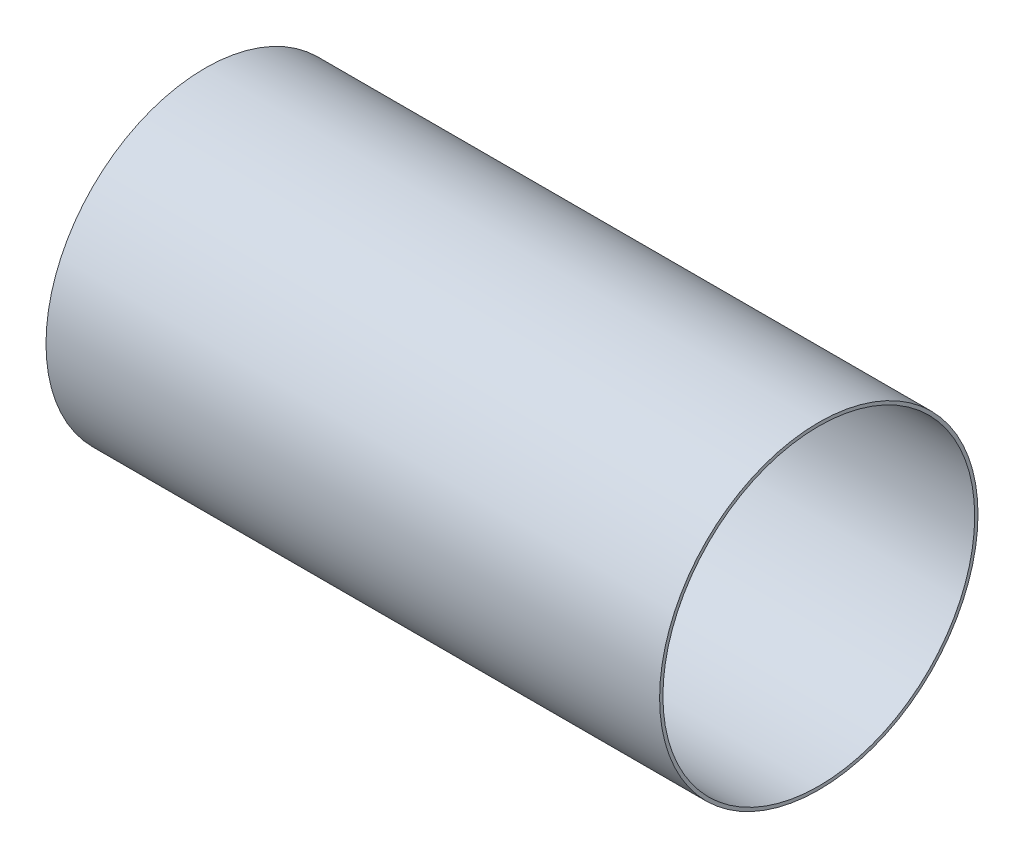
ISO-10303-21;
HEADER;
FILE_DESCRIPTION(('STEP AP214'),'2;1');
FILE_NAME('part.step','',(''),(''),'','','');
FILE_SCHEMA(('AUTOMOTIVE_DESIGN { 1 0 10303 214 1 1 1 1 }'));
ENDSEC;
DATA;
#1=APPLICATION_CONTEXT('core data for automotive mechanical design processes');
#2=APPLICATION_PROTOCOL_DEFINITION('international standard','automotive_design',2000,#1);
#3=PRODUCT_CONTEXT('',#1,'mechanical');
#4=PRODUCT('Part','Part','',(#3));
#5=PRODUCT_RELATED_PRODUCT_CATEGORY('part','',(#4));
#6=PRODUCT_DEFINITION_FORMATION('','',#4);
#7=PRODUCT_DEFINITION_CONTEXT('part definition',#1,'design');
#8=PRODUCT_DEFINITION('design','',#6,#7);
#9=PRODUCT_DEFINITION_SHAPE('','',#8);
#10=(LENGTH_UNIT() NAMED_UNIT(*) SI_UNIT(.MILLI.,.METRE.));
#11=(NAMED_UNIT(*) PLANE_ANGLE_UNIT() SI_UNIT($,.RADIAN.));
#12=(NAMED_UNIT(*) SI_UNIT($,.STERADIAN.) SOLID_ANGLE_UNIT());
#13=UNCERTAINTY_MEASURE_WITH_UNIT(LENGTH_MEASURE(1.E-05),#10,'distance_accuracy_value','');
#14=(GEOMETRIC_REPRESENTATION_CONTEXT(3) GLOBAL_UNCERTAINTY_ASSIGNED_CONTEXT((#13)) GLOBAL_UNIT_ASSIGNED_CONTEXT((#10,
#11,#12)) REPRESENTATION_CONTEXT('',''));
#15=CARTESIAN_POINT('',(0.,0.,0.));
#16=DIRECTION('',(0.,0.,1.));
#17=DIRECTION('',(1.,0.,0.));
#18=AXIS2_PLACEMENT_3D('',#15,#16,#17);
#19=CARTESIAN_POINT('',(0.,9.6,0.));
#20=DIRECTION('',(-1.,0.,0.));
#21=DIRECTION('',(0.,0.,1.));
#22=AXIS2_PLACEMENT_3D('',#19,#20,#21);
#23=PLANE('',#22);
#24=CARTESIAN_POINT('',(0.,0.,0.));
#25=DIRECTION('',(1.,0.,0.));
#26=DIRECTION('',(0.,0.,-1.));
#27=AXIS2_PLACEMENT_3D('',#24,#25,#26);
#28=CIRCLE('',#27,9.4);
#29=CARTESIAN_POINT('',(0.,0.,-9.4));
#30=VERTEX_POINT('',#29);
#31=EDGE_CURVE('E10',#30,#30,#28,.T.);
#32=ORIENTED_EDGE('',*,*,#31,.T.);
#33=EDGE_LOOP('',(#32));
#34=FACE_BOUND('',#33,.T.);
#35=CARTESIAN_POINT('',(0.,0.,0.));
#36=DIRECTION('',(1.,0.,0.));
#37=DIRECTION('',(0.,0.,-1.));
#38=AXIS2_PLACEMENT_3D('',#35,#36,#37);
#39=CIRCLE('',#38,9.6);
#40=CARTESIAN_POINT('',(0.,0.,-9.6));
#41=VERTEX_POINT('',#40);
#42=EDGE_CURVE('E49',#41,#41,#39,.T.);
#43=ORIENTED_EDGE('',*,*,#42,.F.);
#44=EDGE_LOOP('',(#43));
#45=FACE_BOUND('',#44,.T.);
#46=ADVANCED_FACE('F35',(#34,#45),#23,.T.);
#47=CARTESIAN_POINT('',(88.99,0.,0.));
#48=DIRECTION('',(1.,0.,0.));
#49=DIRECTION('',(0.,0.,-1.));
#50=AXIS2_PLACEMENT_3D('',#47,#48,#49);
#51=CYLINDRICAL_SURFACE('',#50,9.4);
#52=CARTESIAN_POINT('',(37.,0.,0.));
#53=DIRECTION('',(1.,0.,0.));
#54=DIRECTION('',(0.,0.,-1.));
#55=AXIS2_PLACEMENT_3D('',#52,#53,#54);
#56=CIRCLE('',#55,9.4);
#57=CARTESIAN_POINT('',(37.,0.,-9.4));
#58=VERTEX_POINT('',#57);
#59=EDGE_CURVE('E41',#58,#58,#56,.T.);
#60=ORIENTED_EDGE('',*,*,#59,.T.);
#61=EDGE_LOOP('',(#60));
#62=FACE_BOUND('',#61,.T.);
#63=ORIENTED_EDGE('',*,*,#31,.F.);
#64=EDGE_LOOP('',(#63));
#65=FACE_BOUND('',#64,.T.);
#66=ADVANCED_FACE('F59',(#62,#65),#51,.F.);
#67=CARTESIAN_POINT('',(37.,9.6,0.));
#68=DIRECTION('',(1.,0.,0.));
#69=DIRECTION('',(0.,0.,-1.));
#70=AXIS2_PLACEMENT_3D('',#67,#68,#69);
#71=PLANE('',#70);
#72=CARTESIAN_POINT('',(37.,0.,0.));
#73=DIRECTION('',(1.,0.,0.));
#74=DIRECTION('',(0.,0.,-1.));
#75=AXIS2_PLACEMENT_3D('',#72,#73,#74);
#76=CIRCLE('',#75,9.6);
#77=CARTESIAN_POINT('',(37.,0.,-9.6));
#78=VERTEX_POINT('',#77);
#79=EDGE_CURVE('E45',#78,#78,#76,.T.);
#80=ORIENTED_EDGE('',*,*,#79,.T.);
#81=EDGE_LOOP('',(#80));
#82=FACE_BOUND('',#81,.T.);
#83=ORIENTED_EDGE('',*,*,#59,.F.);
#84=EDGE_LOOP('',(#83));
#85=FACE_BOUND('',#84,.T.);
#86=ADVANCED_FACE('F63',(#82,#85),#71,.T.);
#87=CARTESIAN_POINT('',(88.99,0.,0.));
#88=DIRECTION('',(1.,0.,0.));
#89=DIRECTION('',(0.,0.,-1.));
#90=AXIS2_PLACEMENT_3D('',#87,#88,#89);
#91=CYLINDRICAL_SURFACE('',#90,9.6);
#92=ORIENTED_EDGE('',*,*,#42,.T.);
#93=EDGE_LOOP('',(#92));
#94=FACE_BOUND('',#93,.T.);
#95=ORIENTED_EDGE('',*,*,#79,.F.);
#96=EDGE_LOOP('',(#95));
#97=FACE_BOUND('',#96,.T.);
#98=ADVANCED_FACE('F55',(#94,#97),#91,.T.);
#99=CLOSED_SHELL('',(#46,#66,#86,#98));
#100=MANIFOLD_SOLID_BREP('B2',#99);
#101=ADVANCED_BREP_SHAPE_REPRESENTATION('',(#18,#100),#14);
#102=SHAPE_DEFINITION_REPRESENTATION(#9,#101);
ENDSEC;
END-ISO-10303-21;
